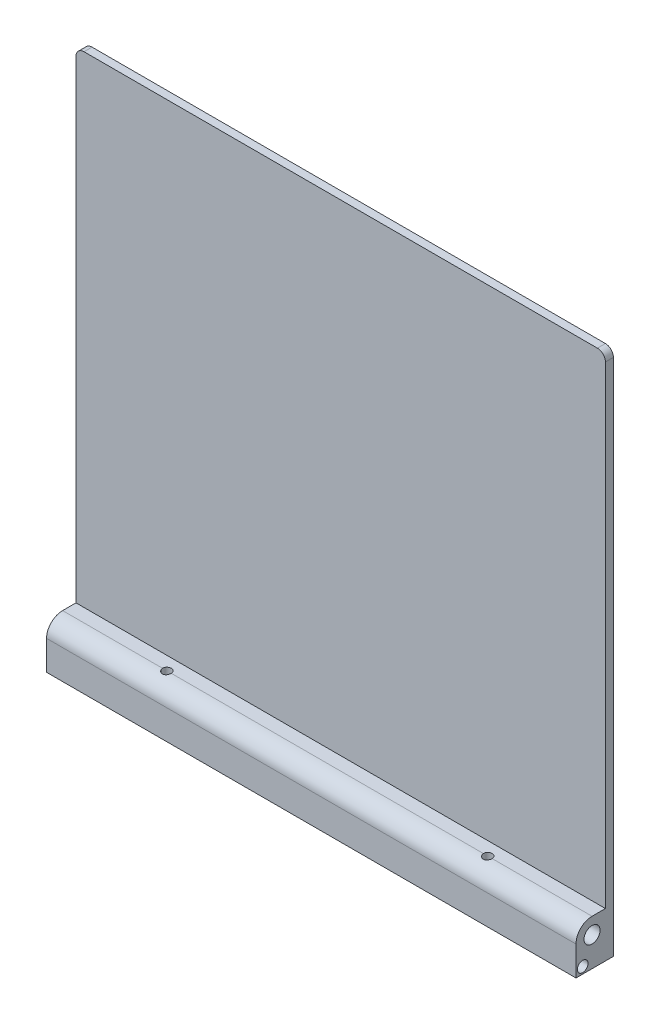
ISO-10303-21;
HEADER;
FILE_DESCRIPTION(('STEP AP214'),'2;1');
FILE_NAME('part.step','',(''),(''),'','','');
FILE_SCHEMA(('AUTOMOTIVE_DESIGN { 1 0 10303 214 1 1 1 1 }'));
ENDSEC;
DATA;
#1=APPLICATION_CONTEXT('core data for automotive mechanical design processes');
#2=APPLICATION_PROTOCOL_DEFINITION('international standard','automotive_design',2000,#1);
#3=PRODUCT_CONTEXT('',#1,'mechanical');
#4=PRODUCT('Part','Part','',(#3));
#5=PRODUCT_RELATED_PRODUCT_CATEGORY('part','',(#4));
#6=PRODUCT_DEFINITION_FORMATION('','',#4);
#7=PRODUCT_DEFINITION_CONTEXT('part definition',#1,'design');
#8=PRODUCT_DEFINITION('design','',#6,#7);
#9=PRODUCT_DEFINITION_SHAPE('','',#8);
#10=(LENGTH_UNIT() NAMED_UNIT(*) SI_UNIT(.MILLI.,.METRE.));
#11=(NAMED_UNIT(*) PLANE_ANGLE_UNIT() SI_UNIT($,.RADIAN.));
#12=(NAMED_UNIT(*) SI_UNIT($,.STERADIAN.) SOLID_ANGLE_UNIT());
#13=UNCERTAINTY_MEASURE_WITH_UNIT(LENGTH_MEASURE(1.E-05),#10,'distance_accuracy_value','');
#14=(GEOMETRIC_REPRESENTATION_CONTEXT(3) GLOBAL_UNCERTAINTY_ASSIGNED_CONTEXT((#13)) GLOBAL_UNIT_ASSIGNED_CONTEXT((#10,
#11,#12)) REPRESENTATION_CONTEXT('',''));
#15=CARTESIAN_POINT('',(0.,0.,0.));
#16=DIRECTION('',(0.,0.,1.));
#17=DIRECTION('',(1.,0.,0.));
#18=AXIS2_PLACEMENT_3D('',#15,#16,#17);
#19=CARTESIAN_POINT('',(216.439088914586,-6.,8.00000000000001));
#20=DIRECTION('',(-1.,0.,0.));
#21=DIRECTION('',(0.,0.,1.));
#22=AXIS2_PLACEMENT_3D('',#19,#20,#21);
#23=CYLINDRICAL_SURFACE('',#22,6.);
#24=CARTESIAN_POINT('',(0.,-6.,8.00000000000001));
#25=DIRECTION('',(-1.,0.,0.));
#26=DIRECTION('',(0.,0.,1.));
#27=AXIS2_PLACEMENT_3D('',#24,#25,#26);
#28=CIRCLE('',#27,6.);
#29=CARTESIAN_POINT('',(0.,-6.,14.));
#30=VERTEX_POINT('',#29);
#31=CARTESIAN_POINT('',(0.,0.,8.00000000000001));
#32=VERTEX_POINT('',#31);
#33=EDGE_CURVE('E249',#30,#32,#28,.T.);
#34=ORIENTED_EDGE('',*,*,#33,.F.);
#35=DIRECTION('',(-1.,0.,0.));
#36=VECTOR('',#35,1.);
#37=CARTESIAN_POINT('',(215.804493814765,-6.,14.));
#38=LINE('',#37,#36);
#39=CARTESIAN_POINT('',(198.,-6.,14.));
#40=VERTEX_POINT('',#39);
#41=EDGE_CURVE('E157',#40,#30,#38,.T.);
#42=ORIENTED_EDGE('',*,*,#41,.F.);
#43=CARTESIAN_POINT('',(198.,-6.,8.00000000000001));
#44=DIRECTION('',(-1.,0.,0.));
#45=DIRECTION('',(0.,0.,1.));
#46=AXIS2_PLACEMENT_3D('',#43,#44,#45);
#47=CIRCLE('',#46,6.);
#48=CARTESIAN_POINT('',(198.,0.,8.00000000000001));
#49=VERTEX_POINT('',#48);
#50=EDGE_CURVE('E243',#49,#40,#47,.F.);
#51=ORIENTED_EDGE('',*,*,#50,.F.);
#52=DIRECTION('',(-1.,0.,0.));
#53=VECTOR('',#52,1.);
#54=CARTESIAN_POINT('',(216.439088914586,0.,8.00000000000001));
#55=LINE('',#54,#53);
#56=CARTESIAN_POINT('',(160.650000000001,0.,8.00000000000001));
#57=VERTEX_POINT('',#56);
#58=EDGE_CURVE('E240',#49,#57,#55,.T.);
#59=ORIENTED_EDGE('',*,*,#58,.T.);
#60=CARTESIAN_POINT('',(159.000000000001,-0.231334643091484,9.65000000000108));
#61=CARTESIAN_POINT('',(159.090780446643,-0.231333184577869,9.6499980374458));
#62=CARTESIAN_POINT('',(159.181581230617,-0.2291683151038,9.64248258154236));
#63=CARTESIAN_POINT('',(159.360552707724,-0.220770681012636,9.6126811316094));
#64=CARTESIAN_POINT('',(159.448722170135,-0.214536043124084,9.59038833565297));
#65=CARTESIAN_POINT('',(159.61981578719,-0.198757204100084,9.53182668713323));
#66=CARTESIAN_POINT('',(159.702747429605,-0.189217859935664,9.49557833657857));
#67=CARTESIAN_POINT('',(159.861367218156,-0.167910731752652,9.4101995918548));
#68=CARTESIAN_POINT('',(159.93705467109,-0.156142734792821,9.36106796655389));
#69=CARTESIAN_POINT('',(160.081050462319,-0.131353471100434,9.24991964519009));
#70=CARTESIAN_POINT('',(160.149137611229,-0.118308873369947,9.18762153463272));
#71=CARTESIAN_POINT('',(160.27404120176,-0.0926370696256836,9.05251338107121));
#72=CARTESIAN_POINT('',(160.330856411459,-0.0800099093596002,8.97970219058304));
#73=CARTESIAN_POINT('',(160.432534803774,-0.0563342433707218,8.82409141792287));
#74=CARTESIAN_POINT('',(160.47717673638,-0.0453164621374391,8.74114218631693));
#75=CARTESIAN_POINT('',(160.551796138776,-0.0263694623862123,8.56856133857666));
#76=CARTESIAN_POINT('',(160.581776244723,-0.0184396887050379,8.47893092704279));
#77=CARTESIAN_POINT('',(160.625501244684,-0.0067271709789311,8.29784211079025));
#78=CARTESIAN_POINT('',(160.639622716018,-0.00284839647898989,8.20648095369833));
#79=CARTESIAN_POINT('',(160.652415798681,0.000661429832006318,8.02260946272118));
#80=CARTESIAN_POINT('',(160.651090153618,0.000293235959670551,7.9300993358235));
#81=CARTESIAN_POINT('',(160.633288853611,-0.00457961948819231,7.74918199533245));
#82=CARTESIAN_POINT('',(160.617220272018,-0.00897313171134139,7.66073127381515));
#83=CARTESIAN_POINT('',(160.571048615408,-0.0212708766331154,7.48783375996964));
#84=CARTESIAN_POINT('',(160.540944715667,-0.0291753156347073,7.40338720324994));
#85=CARTESIAN_POINT('',(160.467253854455,-0.0477689263613935,7.23987323009191));
#86=CARTESIAN_POINT('',(160.423530199888,-0.0584861483746638,7.16087073803445));
#87=CARTESIAN_POINT('',(160.323946608355,-0.0815547954136656,7.01118747141222));
#88=CARTESIAN_POINT('',(160.268084177406,-0.0939065560607308,6.94050841155361));
#89=CARTESIAN_POINT('',(160.143659388682,-0.119384670541564,6.8070481506678));
#90=CARTESIAN_POINT('',(160.074742454414,-0.132523149402228,6.74459943425751));
#91=CARTESIAN_POINT('',(159.927279578084,-0.157733376834685,6.6320615138026));
#92=CARTESIAN_POINT('',(159.848732969804,-0.169805051501158,6.5819731656208));
#93=CARTESIAN_POINT('',(159.683482923082,-0.191565931641349,6.49530296236955));
#94=CARTESIAN_POINT('',(159.596726812738,-0.201238076703339,6.45881694658834));
#95=CARTESIAN_POINT('',(159.417978385097,-0.21689563764146,6.40105990863508));
#96=CARTESIAN_POINT('',(159.325987468918,-0.222882035000597,6.37978483567586));
#97=CARTESIAN_POINT('',(159.142503589206,-0.230279646794182,6.35363821675315));
#98=CARTESIAN_POINT('',(159.051087152066,-0.231829777142019,6.34826842306065));
#99=CARTESIAN_POINT('',(158.868661469602,-0.230560406123488,6.35270752175291));
#100=CARTESIAN_POINT('',(158.777652178977,-0.227741403654584,6.36251468112917));
#101=CARTESIAN_POINT('',(158.600581121326,-0.21818611700046,6.39658889920001));
#102=CARTESIAN_POINT('',(158.514455856723,-0.211532404882695,6.42055141705246));
#103=CARTESIAN_POINT('',(158.347448316786,-0.195139249995293,6.4819111916512));
#104=CARTESIAN_POINT('',(158.266566759489,-0.18539938569908,6.51931028374496));
#105=CARTESIAN_POINT('',(158.110271905821,-0.163650044115829,6.60747696114744));
#106=CARTESIAN_POINT('',(158.03502884188,-0.15159318670793,6.65853435771715));
#107=CARTESIAN_POINT('',(157.893995637401,-0.12667743556325,6.77221275597697));
#108=CARTESIAN_POINT('',(157.82820739541,-0.113818381485251,6.83483607437254));
#109=CARTESIAN_POINT('',(157.705856644964,-0.0882650060544926,6.97218249409995));
#110=CARTESIAN_POINT('',(157.649643014994,-0.0755881242617806,7.04722029655199));
#111=CARTESIAN_POINT('',(157.550606969559,-0.0522343100453501,7.20595405352921));
#112=CARTESIAN_POINT('',(157.507783842673,-0.0415572713846145,7.28964954776778));
#113=CARTESIAN_POINT('',(157.437145586688,-0.0234749362220139,7.46273498164717));
#114=CARTESIAN_POINT('',(157.409217299066,-0.016045050911557,7.55207604558958));
#115=CARTESIAN_POINT('',(157.368840483033,-0.00518574439174027,7.73441968202578));
#116=CARTESIAN_POINT('',(157.356388288908,-0.00175537585644535,7.82742138206369));
#117=CARTESIAN_POINT('',(157.34755880959,0.000670516910508835,8.01119587731008));
#118=CARTESIAN_POINT('',(157.350671267738,-0.000193180804237091,8.10194263481183));
#119=CARTESIAN_POINT('',(157.371689581811,-0.00593678485058757,8.28156955465771));
#120=CARTESIAN_POINT('',(157.389594818206,-0.0108165229880206,8.37044979501283));
#121=CARTESIAN_POINT('',(157.43939476089,-0.024012898423629,8.54316574584037));
#122=CARTESIAN_POINT('',(157.471180148092,-0.0323026496845086,8.62703516812492));
#123=CARTESIAN_POINT('',(157.547740832633,-0.051454984448929,8.78829796642143));
#124=CARTESIAN_POINT('',(157.592518037685,-0.0623179457584076,8.86569038920186));
#125=CARTESIAN_POINT('',(157.695252035988,-0.0858387553894682,9.01415403207526));
#126=CARTESIAN_POINT('',(157.753542889265,-0.0985383592041446,9.08498744614512));
#127=CARTESIAN_POINT('',(157.881023726441,-0.124141270716246,9.21603947801577));
#128=CARTESIAN_POINT('',(157.950216635353,-0.137044632243324,9.27625523789378));
#129=CARTESIAN_POINT('',(158.099517805202,-0.161949720382164,9.38578701268343));
#130=CARTESIAN_POINT('',(158.179846663218,-0.173922678042025,9.43480949541613));
#131=CARTESIAN_POINT('',(158.34792560602,-0.195193671104267,9.51858609627395));
#132=CARTESIAN_POINT('',(158.435671092429,-0.204493348448847,9.55334897834437));
#133=CARTESIAN_POINT('',(158.602496332204,-0.218160566514748,9.60340195745997));
#134=CARTESIAN_POINT('',(158.68089624802,-0.223059341152634,9.62083357797661));
#135=CARTESIAN_POINT('',(158.839525640346,-0.229646812910847,9.64413270597074));
#136=CARTESIAN_POINT('',(158.919754874757,-0.231335932340569,9.6500017347964));
#137=CARTESIAN_POINT('',(159.000000000001,-0.231334643091484,9.65000000000108));
#138=B_SPLINE_CURVE_WITH_KNOTS('',3,(#60,#61,#62,#63,#64,#65,#66,#67,#68,#69,#70,#71,#72,#73,
#74,#75,#76,#77,#78,#79,#80,#81,#82,#83,#84,#85,#86,#87,#88,#89,#90,#91,#92,#93,#94,#95,#96,#97,
#98,#99,#100,#101,#102,#103,#104,#105,#106,#107,#108,#109,#110,#111,#112,#113,#114,#115,#116,
#117,#118,#119,#120,#121,#122,#123,#124,#125,#126,#127,#128,#129,#130,#131,#132,#133,#134,#135,
#136,#137),.UNSPECIFIED.,.T.,.F.,(4,2,2,2,2,2,2,2,2,2,2,2,2,2,2,2,2,2,2,2,2,2,2,2,2,2,2,2,2,2,2,
2,2,2,2,2,2,2,4),(0.,0.272046051104002,0.544217410515604,0.815990441281146,1.08778945227583,
1.36612384486569,1.64448864015851,1.9276186218504,2.21069767879602,2.48690242321263,
2.76305811084347,3.03181099442103,3.30057967207722,3.57213780160769,3.84375177719018,
4.12421818647044,4.40470401050128,4.68713031851459,4.96948138625912,5.24288876991943,
5.5162649363549,5.7839634844484,6.05169861230975,6.32564040616637,6.59963713140798,
6.88212071608139,7.16458929021239,7.44488018041171,7.7251046673873,7.99620396443573,
8.26729190826143,8.53628224078244,8.80531209172674,9.08187822938632,9.35851869627833,
9.64174339988028,9.9247937719284,10.165299774618,10.4057741306127),.UNSPECIFIED.);
#139=CARTESIAN_POINT('',(157.350000000001,0.,8.00000000000001));
#140=VERTEX_POINT('',#139);
#141=EDGE_CURVE('E165',#140,#57,#138,.T.);
#142=ORIENTED_EDGE('',*,*,#141,.F.);
#143=CARTESIAN_POINT('',(40.6500000000014,0.,8.00000000000001));
#144=VERTEX_POINT('',#143);
#145=EDGE_CURVE('E244',#140,#144,#55,.T.);
#146=ORIENTED_EDGE('',*,*,#145,.T.);
#147=CARTESIAN_POINT('',(39.0000000000014,-0.231334643091483,9.65000000000108));
#148=CARTESIAN_POINT('',(39.0907804466431,-0.231333184577867,9.6499980374458));
#149=CARTESIAN_POINT('',(39.181581230617,-0.229168315103798,9.64248258154236));
#150=CARTESIAN_POINT('',(39.3605527077239,-0.220770681012634,9.61268113160939));
#151=CARTESIAN_POINT('',(39.4487221701346,-0.214536043124083,9.59038833565297));
#152=CARTESIAN_POINT('',(39.6198157871895,-0.198757204100082,9.53182668713322));
#153=CARTESIAN_POINT('',(39.7027474296049,-0.189217859935662,9.49557833657856));
#154=CARTESIAN_POINT('',(39.8613672181562,-0.16791073175265,9.41019959185479));
#155=CARTESIAN_POINT('',(39.9370546710901,-0.156142734792817,9.36106796655388));
#156=CARTESIAN_POINT('',(40.0810504623185,-0.131353471100431,9.24991964519008));
#157=CARTESIAN_POINT('',(40.1491376112293,-0.118308873369944,9.18762153463271));
#158=CARTESIAN_POINT('',(40.2740412017603,-0.0926370696256821,9.05251338107121));
#159=CARTESIAN_POINT('',(40.3308564114592,-0.0800099093595998,8.97970219058304));
#160=CARTESIAN_POINT('',(40.4325348037744,-0.0563342433707219,8.82409141792287));
#161=CARTESIAN_POINT('',(40.4771767363804,-0.0453164621374386,8.74114218631693));
#162=CARTESIAN_POINT('',(40.5517961387761,-0.0263694623862113,8.56856133857664));
#163=CARTESIAN_POINT('',(40.581776244723,-0.0184396887050371,8.47893092704278));
#164=CARTESIAN_POINT('',(40.625501244684,-0.00672717097893109,8.29784211079023));
#165=CARTESIAN_POINT('',(40.6396227160181,-0.00284839647899013,8.20648095369832));
#166=CARTESIAN_POINT('',(40.652415798681,0.000661429832005869,8.02260946272117));
#167=CARTESIAN_POINT('',(40.6510901536176,0.000293235959669928,7.9300993358235));
#168=CARTESIAN_POINT('',(40.6332888536105,-0.00457961948819294,7.74918199533244));
#169=CARTESIAN_POINT('',(40.6172202720181,-0.00897313171134189,7.66073127381514));
#170=CARTESIAN_POINT('',(40.5710486154083,-0.0212708766331157,7.48783375996963));
#171=CARTESIAN_POINT('',(40.5409447156668,-0.0291753156347072,7.40338720324994));
#172=CARTESIAN_POINT('',(40.4672538544547,-0.0477689263613935,7.2398732300919));
#173=CARTESIAN_POINT('',(40.4235301998875,-0.0584861483746643,7.16087073803444));
#174=CARTESIAN_POINT('',(40.3239466083548,-0.0815547954136663,7.01118747141222));
#175=CARTESIAN_POINT('',(40.2680841774063,-0.0939065560607313,6.94050841155362));
#176=CARTESIAN_POINT('',(40.1436593886821,-0.119384670541564,6.80704815066781));
#177=CARTESIAN_POINT('',(40.0747424544139,-0.132523149402227,6.74459943425752));
#178=CARTESIAN_POINT('',(39.9272795780844,-0.157733376834682,6.63206151380261));
#179=CARTESIAN_POINT('',(39.8487329698038,-0.169805051501153,6.58197316562082));
#180=CARTESIAN_POINT('',(39.6834829230824,-0.191565931641342,6.49530296236957));
#181=CARTESIAN_POINT('',(39.5967268127376,-0.201238076703332,6.45881694658837));
#182=CARTESIAN_POINT('',(39.4179783850966,-0.216895637641453,6.40105990863511));
#183=CARTESIAN_POINT('',(39.3259874689185,-0.22288203500059,6.37978483567589));
#184=CARTESIAN_POINT('',(39.1425035892063,-0.230279646794176,6.35363821675317));
#185=CARTESIAN_POINT('',(39.0510871520657,-0.231829777142012,6.34826842306068));
#186=CARTESIAN_POINT('',(38.8686614696015,-0.23056040612348,6.35270752175294));
#187=CARTESIAN_POINT('',(38.7776521789772,-0.227741403654574,6.3625146811292));
#188=CARTESIAN_POINT('',(38.6005811213261,-0.21818611700045,6.39658889920005));
#189=CARTESIAN_POINT('',(38.5144558567235,-0.211532404882687,6.42055141705249));
#190=CARTESIAN_POINT('',(38.3474483167859,-0.195139249995287,6.48191119165123));
#191=CARTESIAN_POINT('',(38.2665667594892,-0.185399385699073,6.51931028374499));
#192=CARTESIAN_POINT('',(38.1102719058213,-0.163650044115822,6.60747696114747));
#193=CARTESIAN_POINT('',(38.03502884188,-0.151593186707925,6.65853435771717));
#194=CARTESIAN_POINT('',(37.8939956374015,-0.126677435563245,6.772212755977));
#195=CARTESIAN_POINT('',(37.8282073954098,-0.113818381485246,6.83483607437257));
#196=CARTESIAN_POINT('',(37.7058566449638,-0.088265006054486,6.97218249409999));
#197=CARTESIAN_POINT('',(37.6496430149942,-0.0755881242617735,7.04722029655204));
#198=CARTESIAN_POINT('',(37.5506069695589,-0.0522343100453432,7.20595405352927));
#199=CARTESIAN_POINT('',(37.5077838426728,-0.0415572713846083,7.28964954776783));
#200=CARTESIAN_POINT('',(37.4371455866881,-0.0234749362220092,7.46273498164722));
#201=CARTESIAN_POINT('',(37.4092172990656,-0.0160450509115527,7.55207604558962));
#202=CARTESIAN_POINT('',(37.3688404830331,-0.00518574439173754,7.73441968202582));
#203=CARTESIAN_POINT('',(37.356388288908,-0.00175537585644379,7.82742138206373));
#204=CARTESIAN_POINT('',(37.3475588095898,0.000670516910509029,8.01119587731011));
#205=CARTESIAN_POINT('',(37.3506712677378,-0.000193180804237234,8.10194263481186));
#206=CARTESIAN_POINT('',(37.3716895818112,-0.00593678485058871,8.28156955465774));
#207=CARTESIAN_POINT('',(37.3895948182062,-0.0108165229880224,8.37044979501286));
#208=CARTESIAN_POINT('',(37.4393947608899,-0.0240128984236309,8.54316574584039));
#209=CARTESIAN_POINT('',(37.4711801480919,-0.0323026496845098,8.62703516812494));
#210=CARTESIAN_POINT('',(37.5477408326331,-0.0514549844489302,8.78829796642145));
#211=CARTESIAN_POINT('',(37.5925180376848,-0.0623179457584098,8.86569038920188));
#212=CARTESIAN_POINT('',(37.6952520359878,-0.0858387553894722,9.01415403207528));
#213=CARTESIAN_POINT('',(37.7535428892647,-0.0985383592041496,9.08498744614514));
#214=CARTESIAN_POINT('',(37.8810237264411,-0.124141270716251,9.21603947801579));
#215=CARTESIAN_POINT('',(37.9502166353535,-0.137044632243327,9.2762552378938));
#216=CARTESIAN_POINT('',(38.0995178052019,-0.161949720382166,9.38578701268344));
#217=CARTESIAN_POINT('',(38.1798466632184,-0.173922678042027,9.43480949541613));
#218=CARTESIAN_POINT('',(38.3479256060203,-0.195193671104268,9.51858609627395));
#219=CARTESIAN_POINT('',(38.4356710924295,-0.204493348448847,9.55334897834437));
#220=CARTESIAN_POINT('',(38.6024963322037,-0.218160566514748,9.60340195745997));
#221=CARTESIAN_POINT('',(38.6808962480202,-0.223059341152634,9.62083357797661));
#222=CARTESIAN_POINT('',(38.8395256403459,-0.229646812910847,9.64413270597074));
#223=CARTESIAN_POINT('',(38.919754874757,-0.231335932340569,9.6500017347964));
#224=CARTESIAN_POINT('',(39.0000000000014,-0.231334643091483,9.65000000000108));
#225=B_SPLINE_CURVE_WITH_KNOTS('',3,(#147,#148,#149,#150,#151,#152,#153,#154,#155,#156,#157,
#158,#159,#160,#161,#162,#163,#164,#165,#166,#167,#168,#169,#170,#171,#172,#173,#174,#175,#176,
#177,#178,#179,#180,#181,#182,#183,#184,#185,#186,#187,#188,#189,#190,#191,#192,#193,#194,#195,
#196,#197,#198,#199,#200,#201,#202,#203,#204,#205,#206,#207,#208,#209,#210,#211,#212,#213,#214,
#215,#216,#217,#218,#219,#220,#221,#222,#223,#224),.UNSPECIFIED.,.T.,.F.,(4,2,2,2,2,2,2,2,2,2,2,
2,2,2,2,2,2,2,2,2,2,2,2,2,2,2,2,2,2,2,2,2,2,2,2,2,2,2,4),(0.,0.272046051104002,
0.544217410515611,0.815990441281157,1.08778945227585,1.36612384486568,1.64448864015849,
1.92761862185039,2.21069767879602,2.48690242321262,2.76305811084346,3.03181099442102,
3.3005796720772,3.57213780160768,3.84375177719016,4.12421818647042,4.40470401050123,
4.68713031851455,4.96948138625906,5.24288876991938,5.51626493635488,5.78396348444836,
6.05169861230971,6.32564040616631,6.59963713140793,6.88212071608136,7.16458929021236,
7.44488018041166,7.72510466738725,7.99620396443568,8.26729190826136,8.53628224078237,
8.80531209172667,9.08187822938626,9.35851869627828,9.64174339988022,9.9247937719283,
10.1652997746179,10.4057741306126),.UNSPECIFIED.);
#226=CARTESIAN_POINT('',(37.3500000000014,0.,8.00000000000001));
#227=VERTEX_POINT('',#226);
#228=EDGE_CURVE('E173',#227,#144,#225,.T.);
#229=ORIENTED_EDGE('',*,*,#228,.F.);
#230=EDGE_CURVE('E245',#227,#32,#55,.T.);
#231=ORIENTED_EDGE('',*,*,#230,.T.);
#232=EDGE_LOOP('',(#34,#42,#51,#59,#142,#146,#229,#231));
#233=FACE_BOUND('',#232,.T.);
#234=ADVANCED_FACE('F36',(#233),#23,.T.);
#235=CARTESIAN_POINT('',(0.,0.,3.));
#236=DIRECTION('',(1.,0.,0.));
#237=DIRECTION('',(0.,0.,-1.));
#238=AXIS2_PLACEMENT_3D('',#235,#236,#237);
#239=PLANE('',#238);
#240=CARTESIAN_POINT('',(0.,-14.5,11.5));
#241=DIRECTION('',(1.,0.,0.));
#242=DIRECTION('',(0.,0.,-1.));
#243=AXIS2_PLACEMENT_3D('',#240,#241,#242);
#244=CIRCLE('',#243,2.);
#245=CARTESIAN_POINT('',(0.,-14.5,9.50000000000001));
#246=VERTEX_POINT('',#245);
#247=EDGE_CURVE('E429',#246,#246,#244,.T.);
#248=ORIENTED_EDGE('',*,*,#247,.T.);
#249=EDGE_LOOP('',(#248));
#250=FACE_BOUND('',#249,.T.);
#251=CARTESIAN_POINT('',(0.,-6.,8.00000000000001));
#252=DIRECTION('',(-1.,0.,0.));
#253=DIRECTION('',(0.,0.,1.));
#254=AXIS2_PLACEMENT_3D('',#251,#252,#253);
#255=CIRCLE('',#254,3.);
#256=CARTESIAN_POINT('',(0.,-6.,11.));
#257=VERTEX_POINT('',#256);
#258=EDGE_CURVE('E251',#257,#257,#255,.T.);
#259=ORIENTED_EDGE('',*,*,#258,.F.);
#260=EDGE_LOOP('',(#259));
#261=FACE_BOUND('',#260,.T.);
#262=DIRECTION('',(0.,-1.,0.));
#263=VECTOR('',#262,1.);
#264=CARTESIAN_POINT('',(0.,0.,0.));
#265=LINE('',#264,#263);
#266=CARTESIAN_POINT('',(0.,177.,0.));
#267=VERTEX_POINT('',#266);
#268=CARTESIAN_POINT('',(0.,-17.,0.));
#269=VERTEX_POINT('',#268);
#270=EDGE_CURVE('E121',#267,#269,#265,.T.);
#271=ORIENTED_EDGE('',*,*,#270,.T.);
#272=DIRECTION('',(0.,0.,1.));
#273=VECTOR('',#272,1.);
#274=CARTESIAN_POINT('',(0.,-17.,0.));
#275=LINE('',#274,#273);
#276=CARTESIAN_POINT('',(0.,-17.,14.));
#277=VERTEX_POINT('',#276);
#278=EDGE_CURVE('E126',#269,#277,#275,.T.);
#279=ORIENTED_EDGE('',*,*,#278,.T.);
#280=DIRECTION('',(0.,1.,0.));
#281=VECTOR('',#280,1.);
#282=CARTESIAN_POINT('',(0.,-17.,14.));
#283=LINE('',#282,#281);
#284=EDGE_CURVE('E146',#277,#30,#283,.T.);
#285=ORIENTED_EDGE('',*,*,#284,.T.);
#286=ORIENTED_EDGE('',*,*,#33,.T.);
#287=DIRECTION('',(0.,0.,-1.));
#288=VECTOR('',#287,1.);
#289=CARTESIAN_POINT('',(0.,0.,0.));
#290=LINE('',#289,#288);
#291=CARTESIAN_POINT('',(0.,0.,3.));
#292=VERTEX_POINT('',#291);
#293=EDGE_CURVE('E246',#32,#292,#290,.T.);
#294=ORIENTED_EDGE('',*,*,#293,.T.);
#295=DIRECTION('',(0.,-1.,0.));
#296=VECTOR('',#295,1.);
#297=CARTESIAN_POINT('',(0.,0.,3.));
#298=LINE('',#297,#296);
#299=CARTESIAN_POINT('',(0.,177.,3.));
#300=VERTEX_POINT('',#299);
#301=EDGE_CURVE('E231',#300,#292,#298,.T.);
#302=ORIENTED_EDGE('',*,*,#301,.F.);
#303=DIRECTION('',(0.,0.,-1.));
#304=VECTOR('',#303,1.);
#305=CARTESIAN_POINT('',(0.,177.,3.));
#306=LINE('',#305,#304);
#307=EDGE_CURVE('E11',#300,#267,#306,.T.);
#308=ORIENTED_EDGE('',*,*,#307,.T.);
#309=EDGE_LOOP('',(#271,#279,#285,#286,#294,#302,#308));
#310=FACE_BOUND('',#309,.T.);
#311=ADVANCED_FACE('F123',(#250,#261,#310),#239,.F.);
#312=CARTESIAN_POINT('',(198.,0.,3.));
#313=DIRECTION('',(-1.,0.,0.));
#314=DIRECTION('',(0.,0.,1.));
#315=AXIS2_PLACEMENT_3D('',#312,#313,#314);
#316=PLANE('',#315);
#317=CARTESIAN_POINT('',(198.,-14.5,11.5));
#318=DIRECTION('',(1.,0.,0.));
#319=DIRECTION('',(0.,0.,-1.));
#320=AXIS2_PLACEMENT_3D('',#317,#318,#319);
#321=CIRCLE('',#320,2.);
#322=CARTESIAN_POINT('',(198.,-14.5,9.50000000000001));
#323=VERTEX_POINT('',#322);
#324=EDGE_CURVE('E151',#323,#323,#321,.T.);
#325=ORIENTED_EDGE('',*,*,#324,.F.);
#326=EDGE_LOOP('',(#325));
#327=FACE_BOUND('',#326,.T.);
#328=DIRECTION('',(0.,1.,0.));
#329=VECTOR('',#328,1.);
#330=CARTESIAN_POINT('',(198.,0.,0.));
#331=LINE('',#330,#329);
#332=CARTESIAN_POINT('',(198.,-17.,0.));
#333=VERTEX_POINT('',#332);
#334=CARTESIAN_POINT('',(198.,177.,0.));
#335=VERTEX_POINT('',#334);
#336=EDGE_CURVE('E129',#333,#335,#331,.T.);
#337=ORIENTED_EDGE('',*,*,#336,.T.);
#338=DIRECTION('',(0.,0.,-1.));
#339=VECTOR('',#338,1.);
#340=CARTESIAN_POINT('',(198.,177.,3.));
#341=LINE('',#340,#339);
#342=CARTESIAN_POINT('',(198.,177.,3.));
#343=VERTEX_POINT('',#342);
#344=EDGE_CURVE('E59',#335,#343,#341,.F.);
#345=ORIENTED_EDGE('',*,*,#344,.T.);
#346=DIRECTION('',(0.,1.,0.));
#347=VECTOR('',#346,1.);
#348=CARTESIAN_POINT('',(198.,0.,3.));
#349=LINE('',#348,#347);
#350=CARTESIAN_POINT('',(198.,0.,3.));
#351=VERTEX_POINT('',#350);
#352=EDGE_CURVE('E221',#351,#343,#349,.T.);
#353=ORIENTED_EDGE('',*,*,#352,.F.);
#354=DIRECTION('',(0.,0.,1.));
#355=VECTOR('',#354,1.);
#356=CARTESIAN_POINT('',(198.,0.,0.));
#357=LINE('',#356,#355);
#358=EDGE_CURVE('E239',#351,#49,#357,.T.);
#359=ORIENTED_EDGE('',*,*,#358,.T.);
#360=ORIENTED_EDGE('',*,*,#50,.T.);
#361=DIRECTION('',(0.,-1.,0.));
#362=VECTOR('',#361,1.);
#363=CARTESIAN_POINT('',(198.,-17.,14.));
#364=LINE('',#363,#362);
#365=CARTESIAN_POINT('',(198.,-17.,14.));
#366=VERTEX_POINT('',#365);
#367=EDGE_CURVE('E154',#40,#366,#364,.T.);
#368=ORIENTED_EDGE('',*,*,#367,.T.);
#369=DIRECTION('',(0.,0.,-1.));
#370=VECTOR('',#369,1.);
#371=CARTESIAN_POINT('',(198.,-17.,0.));
#372=LINE('',#371,#370);
#373=EDGE_CURVE('E140',#366,#333,#372,.T.);
#374=ORIENTED_EDGE('',*,*,#373,.T.);
#375=EDGE_LOOP('',(#337,#345,#353,#359,#360,#368,#374));
#376=FACE_BOUND('',#375,.T.);
#377=CARTESIAN_POINT('',(198.,-6.,8.00000000000001));
#378=DIRECTION('',(-1.,0.,0.));
#379=DIRECTION('',(0.,0.,1.));
#380=AXIS2_PLACEMENT_3D('',#377,#378,#379);
#381=CIRCLE('',#380,3.);
#382=CARTESIAN_POINT('',(198.,-6.,11.));
#383=VERTEX_POINT('',#382);
#384=EDGE_CURVE('E130',#383,#383,#381,.F.);
#385=ORIENTED_EDGE('',*,*,#384,.F.);
#386=EDGE_LOOP('',(#385));
#387=FACE_BOUND('',#386,.T.);
#388=ADVANCED_FACE('F257',(#327,#376,#387),#316,.F.);
#389=CARTESIAN_POINT('',(0.,180.,3.));
#390=DIRECTION('',(0.,-1.,0.));
#391=DIRECTION('',(0.,0.,-1.));
#392=AXIS2_PLACEMENT_3D('',#389,#390,#391);
#393=PLANE('',#392);
#394=DIRECTION('',(-1.,0.,0.));
#395=VECTOR('',#394,1.);
#396=CARTESIAN_POINT('',(0.,180.,3.));
#397=LINE('',#396,#395);
#398=CARTESIAN_POINT('',(195.,180.,3.));
#399=VERTEX_POINT('',#398);
#400=CARTESIAN_POINT('',(3.,180.,3.));
#401=VERTEX_POINT('',#400);
#402=EDGE_CURVE('E210',#399,#401,#397,.T.);
#403=ORIENTED_EDGE('',*,*,#402,.F.);
#404=DIRECTION('',(0.,0.,-1.));
#405=VECTOR('',#404,1.);
#406=CARTESIAN_POINT('',(195.,180.,3.));
#407=LINE('',#406,#405);
#408=CARTESIAN_POINT('',(195.,180.,0.));
#409=VERTEX_POINT('',#408);
#410=EDGE_CURVE('E209',#399,#409,#407,.T.);
#411=ORIENTED_EDGE('',*,*,#410,.T.);
#412=DIRECTION('',(-1.,0.,0.));
#413=VECTOR('',#412,1.);
#414=CARTESIAN_POINT('',(0.,180.,0.));
#415=LINE('',#414,#413);
#416=CARTESIAN_POINT('',(3.,180.,0.));
#417=VERTEX_POINT('',#416);
#418=EDGE_CURVE('E200',#409,#417,#415,.T.);
#419=ORIENTED_EDGE('',*,*,#418,.T.);
#420=DIRECTION('',(0.,0.,-1.));
#421=VECTOR('',#420,1.);
#422=CARTESIAN_POINT('',(3.,180.,3.));
#423=LINE('',#422,#421);
#424=EDGE_CURVE('E207',#417,#401,#423,.F.);
#425=ORIENTED_EDGE('',*,*,#424,.T.);
#426=EDGE_LOOP('',(#403,#411,#419,#425));
#427=FACE_BOUND('',#426,.T.);
#428=ADVANCED_FACE('F225',(#427),#393,.F.);
#429=CARTESIAN_POINT('',(0.,0.,3.));
#430=DIRECTION('',(0.,0.,-1.));
#431=DIRECTION('',(-1.,0.,0.));
#432=AXIS2_PLACEMENT_3D('',#429,#430,#431);
#433=PLANE('',#432);
#434=ORIENTED_EDGE('',*,*,#352,.T.);
#435=CARTESIAN_POINT('',(195.,177.,3.));
#436=DIRECTION('',(0.,0.,-1.));
#437=DIRECTION('',(-1.,0.,0.));
#438=AXIS2_PLACEMENT_3D('',#435,#436,#437);
#439=CIRCLE('',#438,3.);
#440=EDGE_CURVE('E44',#343,#399,#439,.F.);
#441=ORIENTED_EDGE('',*,*,#440,.T.);
#442=ORIENTED_EDGE('',*,*,#402,.T.);
#443=CARTESIAN_POINT('',(3.,177.,3.));
#444=DIRECTION('',(0.,0.,-1.));
#445=DIRECTION('',(-1.,0.,0.));
#446=AXIS2_PLACEMENT_3D('',#443,#444,#445);
#447=CIRCLE('',#446,3.);
#448=EDGE_CURVE('E51',#401,#300,#447,.F.);
#449=ORIENTED_EDGE('',*,*,#448,.T.);
#450=ORIENTED_EDGE('',*,*,#301,.T.);
#451=DIRECTION('',(1.,0.,0.));
#452=VECTOR('',#451,1.);
#453=CARTESIAN_POINT('',(0.,0.,3.));
#454=LINE('',#453,#452);
#455=EDGE_CURVE('E232',#292,#351,#454,.T.);
#456=ORIENTED_EDGE('',*,*,#455,.T.);
#457=EDGE_LOOP('',(#434,#441,#442,#449,#450,#456));
#458=FACE_BOUND('',#457,.T.);
#459=ADVANCED_FACE('F220',(#458),#433,.F.);
#460=CARTESIAN_POINT('',(0.,0.,0.));
#461=DIRECTION('',(0.,0.,-1.));
#462=DIRECTION('',(-1.,0.,0.));
#463=AXIS2_PLACEMENT_3D('',#460,#461,#462);
#464=PLANE('',#463);
#465=CARTESIAN_POINT('',(195.,177.,0.));
#466=DIRECTION('',(0.,0.,-1.));
#467=DIRECTION('',(-1.,0.,0.));
#468=AXIS2_PLACEMENT_3D('',#465,#466,#467);
#469=CIRCLE('',#468,3.);
#470=EDGE_CURVE('E215',#409,#335,#469,.T.);
#471=ORIENTED_EDGE('',*,*,#470,.T.);
#472=ORIENTED_EDGE('',*,*,#336,.F.);
#473=DIRECTION('',(1.,0.,0.));
#474=VECTOR('',#473,1.);
#475=CARTESIAN_POINT('',(0.,-17.,0.));
#476=LINE('',#475,#474);
#477=EDGE_CURVE('E133',#269,#333,#476,.T.);
#478=ORIENTED_EDGE('',*,*,#477,.F.);
#479=ORIENTED_EDGE('',*,*,#270,.F.);
#480=CARTESIAN_POINT('',(3.,177.,0.));
#481=DIRECTION('',(0.,0.,-1.));
#482=DIRECTION('',(-1.,0.,0.));
#483=AXIS2_PLACEMENT_3D('',#480,#481,#482);
#484=CIRCLE('',#483,3.);
#485=EDGE_CURVE('E213',#267,#417,#484,.T.);
#486=ORIENTED_EDGE('',*,*,#485,.T.);
#487=ORIENTED_EDGE('',*,*,#418,.F.);
#488=EDGE_LOOP('',(#471,#472,#478,#479,#486,#487));
#489=FACE_BOUND('',#488,.T.);
#490=ADVANCED_FACE('F135',(#489),#464,.T.);
#491=CARTESIAN_POINT('',(216.439088914586,0.,0.));
#492=DIRECTION('',(0.,1.,0.));
#493=DIRECTION('',(0.,0.,1.));
#494=AXIS2_PLACEMENT_3D('',#491,#492,#493);
#495=PLANE('',#494);
#496=CARTESIAN_POINT('',(39.0000000000014,0.,8.00000000000108));
#497=DIRECTION('',(0.,1.,0.));
#498=DIRECTION('',(0.,0.,1.));
#499=AXIS2_PLACEMENT_3D('',#496,#497,#498);
#500=CIRCLE('',#499,1.65);
#501=EDGE_CURVE('E161',#144,#227,#500,.T.);
#502=ORIENTED_EDGE('',*,*,#501,.F.);
#503=ORIENTED_EDGE('',*,*,#145,.F.);
#504=CARTESIAN_POINT('',(159.000000000001,0.,8.00000000000107));
#505=DIRECTION('',(0.,1.,0.));
#506=DIRECTION('',(0.,0.,1.));
#507=AXIS2_PLACEMENT_3D('',#504,#505,#506);
#508=CIRCLE('',#507,1.65000000000002);
#509=EDGE_CURVE('E139',#57,#140,#508,.T.);
#510=ORIENTED_EDGE('',*,*,#509,.F.);
#511=ORIENTED_EDGE('',*,*,#58,.F.);
#512=ORIENTED_EDGE('',*,*,#358,.F.);
#513=ORIENTED_EDGE('',*,*,#455,.F.);
#514=ORIENTED_EDGE('',*,*,#293,.F.);
#515=ORIENTED_EDGE('',*,*,#230,.F.);
#516=EDGE_LOOP('',(#502,#503,#510,#511,#512,#513,#514,#515));
#517=FACE_BOUND('',#516,.T.);
#518=ADVANCED_FACE('F268',(#517),#495,.T.);
#519=CARTESIAN_POINT('',(216.439088914586,-6.,8.00000000000001));
#520=DIRECTION('',(-1.,0.,0.));
#521=DIRECTION('',(0.,0.,1.));
#522=AXIS2_PLACEMENT_3D('',#519,#520,#521);
#523=CYLINDRICAL_SURFACE('',#522,3.);
#524=ORIENTED_EDGE('',*,*,#384,.T.);
#525=EDGE_LOOP('',(#524));
#526=FACE_BOUND('',#525,.T.);
#527=CARTESIAN_POINT('',(39.0000000000014,-3.49450603672719,9.65000000000108));
#528=CARTESIAN_POINT('',(39.0845622441256,-3.49449709270925,9.64999358115623));
#529=CARTESIAN_POINT('',(39.1691984196451,-3.49015721695437,9.64345412095617));
#530=CARTESIAN_POINT('',(39.3357580106574,-3.47347694527976,9.61768357796238));
#531=CARTESIAN_POINT('',(39.4176766077384,-3.46112306186729,9.59843109830629));
#532=CARTESIAN_POINT('',(39.5760581583429,-3.43030485576006,9.54839133504233));
#533=CARTESIAN_POINT('',(39.652551663641,-3.41187871746298,9.51767597794628));
#534=CARTESIAN_POINT('',(39.7992707493245,-3.37105426039359,9.44580368027431));
#535=CARTESIAN_POINT('',(39.86949501938,-3.34865511413322,9.40464456372819));
#536=CARTESIAN_POINT('',(40.0094930204873,-3.29965772830572,9.30818987552223));
#537=CARTESIAN_POINT('',(40.0785038569216,-3.27286389707212,9.2518859756865));
#538=CARTESIAN_POINT('',(40.2067154247574,-3.21966597877721,9.12882249865193));
#539=CARTESIAN_POINT('',(40.2659102794468,-3.19326213375017,9.06205670422409));
#540=CARTESIAN_POINT('',(40.3778127875262,-3.14111744666084,8.91298403880362));
#541=CARTESIAN_POINT('',(40.4295270891269,-3.11562817127708,8.82983500932754));
#542=CARTESIAN_POINT('',(40.5178779061816,-3.07083622535249,8.65434955639918));
#543=CARTESIAN_POINT('',(40.5545259108971,-3.05152884311608,8.56202020066096));
#544=CARTESIAN_POINT('',(40.608493984801,-3.02270617669625,8.37892285434443));
#545=CARTESIAN_POINT('',(40.6271681432733,-3.01250999379457,8.28866376218955));
#546=CARTESIAN_POINT('',(40.6491747783533,-3.00046879782476,8.10576884897313));
#547=CARTESIAN_POINT('',(40.6525188859999,-2.99861745347504,8.01313488342847));
#548=CARTESIAN_POINT('',(40.6441598762645,-3.00320873616286,7.83854305725778));
#549=CARTESIAN_POINT('',(40.6339956989633,-3.00880319411728,7.75648296395873));
#550=CARTESIAN_POINT('',(40.6017438606681,-3.02629860909347,7.59545106528745));
#551=CARTESIAN_POINT('',(40.5796552840274,-3.03820005041238,7.51647949757531));
#552=CARTESIAN_POINT('',(40.5241824045513,-3.06741207866691,7.3627205702147));
#553=CARTESIAN_POINT('',(40.4906790487465,-3.08477952262424,7.28798741293562));
#554=CARTESIAN_POINT('',(40.4135685538591,-3.12344578060551,7.14505825869577));
#555=CARTESIAN_POINT('',(40.3699581828163,-3.1447458517372,7.07686436270299));
#556=CARTESIAN_POINT('',(40.2685152499599,-3.1920818561752,6.94108282808258));
#557=CARTESIAN_POINT('',(40.2096560691288,-3.2183807982742,6.87435382804526));
#558=CARTESIAN_POINT('',(40.0820757945517,-3.27144362000169,6.75120622016277));
#559=CARTESIAN_POINT('',(40.0133445587429,-3.29820795258559,6.69479835294653));
#560=CARTESIAN_POINT('',(39.860702045772,-3.35183739258562,6.5889524285302));
#561=CARTESIAN_POINT('',(39.775987825025,-3.37850506442409,6.5405610191552));
#562=CARTESIAN_POINT('',(39.5979123412458,-3.42557330545121,6.45903927559911));
#563=CARTESIAN_POINT('',(39.5045612261064,-3.44598111093299,6.42589129797835));
#564=CARTESIAN_POINT('',(39.3196175660875,-3.47571131114557,6.37867519252511));
#565=CARTESIAN_POINT('',(39.2284922928204,-3.48579611824175,6.36328191851038));
#566=CARTESIAN_POINT('',(39.044438567397,-3.49578867715998,6.34802399451809));
#567=CARTESIAN_POINT('',(38.9515122989963,-3.49570806671375,6.34814158715556));
#568=CARTESIAN_POINT('',(38.781019303226,-3.4861870836415,6.36268933002527));
#569=CARTESIAN_POINT('',(38.7031832372133,-3.4781088171916,6.37503672421015));
#570=CARTESIAN_POINT('',(38.550905157293,-3.45569101683707,6.41036907454818));
#571=CARTESIAN_POINT('',(38.4764646488042,-3.44134873501758,6.43335869952878));
#572=CARTESIAN_POINT('',(38.3294315856607,-3.40735298946975,6.49025912465952));
#573=CARTESIAN_POINT('',(38.2570491793063,-3.38750113804085,6.52458941328384));
#574=CARTESIAN_POINT('',(38.1186384670183,-3.34482474371761,6.6028491192572));
#575=CARTESIAN_POINT('',(38.0526133280187,-3.32199873240428,6.64678328559649));
#576=CARTESIAN_POINT('',(37.9178240171682,-3.27161254019689,6.7510961527158));
#577=CARTESIAN_POINT('',(37.8502833445476,-3.24387528789408,6.81297743965268));
#578=CARTESIAN_POINT('',(37.7260553654188,-3.18978533522668,6.9474096575205));
#579=CARTESIAN_POINT('',(37.6693744233953,-3.16343345330008,7.01996680140781));
#580=CARTESIAN_POINT('',(37.565816435223,-3.11344113825623,7.17840856798357));
#581=CARTESIAN_POINT('',(37.5195801922196,-3.09000523715085,7.26478163550579));
#582=CARTESIAN_POINT('',(37.4427856946255,-3.0501977510135,7.4457304638209));
#583=CARTESIAN_POINT('',(37.4122111394398,-3.0338188239569,7.54029757591576));
#584=CARTESIAN_POINT('',(37.3706938816095,-3.01137674932014,7.72458220200568));
#585=CARTESIAN_POINT('',(37.358069030657,-3.00443294567565,7.81381287057578));
#586=CARTESIAN_POINT('',(37.3475681065668,-2.99866563141353,7.99338323691222));
#587=CARTESIAN_POINT('',(37.3496842641817,-2.99983784324861,8.08372232542616));
#588=CARTESIAN_POINT('',(37.3676699284632,-3.00968957572484,8.25435836629808));
#589=CARTESIAN_POINT('',(37.3822936667957,-3.01768895328183,8.33483136304888));
#590=CARTESIAN_POINT('',(37.4229648219918,-3.03955298974637,8.49198583387791));
#591=CARTESIAN_POINT('',(37.4490136019567,-3.05341834850662,8.56866685432717));
#592=CARTESIAN_POINT('',(37.512612632041,-3.08640124814582,8.71908027948212));
#593=CARTESIAN_POINT('',(37.5505255940464,-3.10568212059096,8.79262229620643));
#594=CARTESIAN_POINT('',(37.636325501489,-3.14768349385245,8.93254240527049));
#595=CARTESIAN_POINT('',(37.6842164806009,-3.17040538470382,8.99891758384575));
#596=CARTESIAN_POINT('',(37.7949260016517,-3.22025482875027,9.13072210629279));
#597=CARTESIAN_POINT('',(37.858827833727,-3.24758854059231,9.19516495605952));
#598=CARTESIAN_POINT('',(37.9965071375533,-3.30176121462997,9.31290440702928));
#599=CARTESIAN_POINT('',(38.0702964652747,-3.32859953815892,9.36618742691478));
#600=CARTESIAN_POINT('',(38.2317240000528,-3.38054891911129,9.46345962344371));
#601=CARTESIAN_POINT('',(38.319956398594,-3.40542700910459,9.50659692748136));
#602=CARTESIAN_POINT('',(38.5041788004101,-3.44747114415782,9.57680093269463));
#603=CARTESIAN_POINT('',(38.6001429528296,-3.46466172463311,9.60391885150263));
#604=CARTESIAN_POINT('',(38.7478087830599,-3.4823307458686,9.63139486596199));
#605=CARTESIAN_POINT('',(38.7978747641614,-3.48686937386928,9.63835444050038));
#606=CARTESIAN_POINT('',(38.8986183124089,-3.49295966763606,9.64765888075723));
#607=CARTESIAN_POINT('',(38.9492958659705,-3.49451139962513,9.65000384878694));
#608=CARTESIAN_POINT('',(39.0000000000014,-3.49450603672719,9.65000000000108));
#609=B_SPLINE_CURVE_WITH_KNOTS('',3,(#527,#528,#529,#530,#531,#532,#533,#534,#535,#536,#537,
#538,#539,#540,#541,#542,#543,#544,#545,#546,#547,#548,#549,#550,#551,#552,#553,#554,#555,#556,
#557,#558,#559,#560,#561,#562,#563,#564,#565,#566,#567,#568,#569,#570,#571,#572,#573,#574,#575,
#576,#577,#578,#579,#580,#581,#582,#583,#584,#585,#586,#587,#588,#589,#590,#591,#592,#593,#594,
#595,#596,#597,#598,#599,#600,#601,#602,#603,#604,#605,#606,#607,#608),.UNSPECIFIED.,.T.,.F.,(4,
2,2,2,2,2,2,2,2,2,2,2,2,2,2,2,2,2,2,2,2,2,2,2,2,2,2,2,2,2,2,2,2,2,2,2,2,2,2,2,4),(0.,
0.253471464978883,0.507370630471886,0.7597027237183,1.01208743389975,1.28998079678307,
1.56803993512362,1.86997289364907,2.17167517502769,2.44828286528195,2.72468065617503,
2.97213663093987,3.21961160997036,3.46975098230544,3.71997045333209,3.99717687977863,
4.27467015892951,4.57652503396555,4.87802964361044,5.15517475627447,5.43200258623565,
5.66859462056201,5.90529054812099,6.15196333618112,6.39875837770531,6.68465599353138,
6.9707206542104,7.27125286686233,7.57147164850528,7.84111747203323,8.11062118950815,
8.35604451303938,8.60149712555482,8.85533990697392,9.10928550569663,9.39243346006442,
9.67592402360686,9.97823556729937,10.2795752459722,10.431561941938,10.5835452681421),.UNSPECIFIED.);
#610=CARTESIAN_POINT('',(39.0000000000014,-3.49450603672719,9.65000000000108));
#611=VERTEX_POINT('',#610);
#612=EDGE_CURVE('E172',#611,#611,#609,.T.);
#613=ORIENTED_EDGE('',*,*,#612,.T.);
#614=EDGE_LOOP('',(#613));
#615=FACE_BOUND('',#614,.T.);
#616=CARTESIAN_POINT('',(159.000000000001,-3.49450603672719,9.65000000000108));
#617=CARTESIAN_POINT('',(159.084562244126,-3.49449709270925,9.64999358115623));
#618=CARTESIAN_POINT('',(159.169198419645,-3.49015721695437,9.64345412095617));
#619=CARTESIAN_POINT('',(159.335758010657,-3.47347694527976,9.61768357796238));
#620=CARTESIAN_POINT('',(159.417676607738,-3.46112306186729,9.59843109830629));
#621=CARTESIAN_POINT('',(159.576058158343,-3.43030485576006,9.54839133504233));
#622=CARTESIAN_POINT('',(159.652551663641,-3.41187871746298,9.51767597794628));
#623=CARTESIAN_POINT('',(159.799270749325,-3.37105426039359,9.44580368027431));
#624=CARTESIAN_POINT('',(159.86949501938,-3.34865511413322,9.40464456372819));
#625=CARTESIAN_POINT('',(160.009493020487,-3.29965772830572,9.30818987552223));
#626=CARTESIAN_POINT('',(160.078503856922,-3.27286389707212,9.25188597568649));
#627=CARTESIAN_POINT('',(160.206715424757,-3.2196659787772,9.12882249865192));
#628=CARTESIAN_POINT('',(160.265910279447,-3.19326213375017,9.06205670422408));
#629=CARTESIAN_POINT('',(160.377812787526,-3.14111744666084,8.91298403880362));
#630=CARTESIAN_POINT('',(160.429527089127,-3.11562817127708,8.82983500932754));
#631=CARTESIAN_POINT('',(160.517877906182,-3.07083622535249,8.65434955639918));
#632=CARTESIAN_POINT('',(160.554525910897,-3.05152884311608,8.56202020066096));
#633=CARTESIAN_POINT('',(160.608493984801,-3.02270617669625,8.37892285434443));
#634=CARTESIAN_POINT('',(160.627168143273,-3.01250999379457,8.28866376218955));
#635=CARTESIAN_POINT('',(160.649174778353,-3.00046879782476,8.10576884897313));
#636=CARTESIAN_POINT('',(160.652518886,-2.99861745347504,8.01313488342848));
#637=CARTESIAN_POINT('',(160.644159876264,-3.00320873616286,7.83854305725778));
#638=CARTESIAN_POINT('',(160.633995698963,-3.00880319411728,7.75648296395873));
#639=CARTESIAN_POINT('',(160.601743860668,-3.02629860909348,7.59545106528744));
#640=CARTESIAN_POINT('',(160.579655284027,-3.03820005041238,7.5164794975753));
#641=CARTESIAN_POINT('',(160.524182404551,-3.06741207866692,7.36272057021469));
#642=CARTESIAN_POINT('',(160.490679048747,-3.08477952262424,7.2879874129356));
#643=CARTESIAN_POINT('',(160.413568553859,-3.12344578060551,7.14505825869576));
#644=CARTESIAN_POINT('',(160.369958182816,-3.1447458517372,7.07686436270298));
#645=CARTESIAN_POINT('',(160.26851524996,-3.19208185617521,6.94108282808258));
#646=CARTESIAN_POINT('',(160.209656069129,-3.2183807982742,6.87435382804525));
#647=CARTESIAN_POINT('',(160.082075794552,-3.2714436200017,6.75120622016276));
#648=CARTESIAN_POINT('',(160.013344558743,-3.2982079525856,6.69479835294652));
#649=CARTESIAN_POINT('',(159.860702045772,-3.35183739258563,6.58895242853018));
#650=CARTESIAN_POINT('',(159.775987825025,-3.3785050644241,6.54056101915518));
#651=CARTESIAN_POINT('',(159.597912341246,-3.42557330545123,6.45903927559909));
#652=CARTESIAN_POINT('',(159.504561226106,-3.445981110933,6.42589129797833));
#653=CARTESIAN_POINT('',(159.319617566087,-3.47571131114559,6.37867519252508));
#654=CARTESIAN_POINT('',(159.22849229282,-3.48579611824176,6.36328191851035));
#655=CARTESIAN_POINT('',(159.044438567397,-3.49578867716,6.34802399451806));
#656=CARTESIAN_POINT('',(158.951512298996,-3.49570806671377,6.34814158715553));
#657=CARTESIAN_POINT('',(158.781019303226,-3.48618708364152,6.36268933002524));
#658=CARTESIAN_POINT('',(158.703183237213,-3.47810881719161,6.37503672421013));
#659=CARTESIAN_POINT('',(158.550905157293,-3.45569101683709,6.41036907454816));
#660=CARTESIAN_POINT('',(158.476464648804,-3.4413487350176,6.43335869952875));
#661=CARTESIAN_POINT('',(158.329431585661,-3.40735298946977,6.49025912465949));
#662=CARTESIAN_POINT('',(158.257049179306,-3.38750113804087,6.52458941328381));
#663=CARTESIAN_POINT('',(158.118638467018,-3.34482474371763,6.60284911925717));
#664=CARTESIAN_POINT('',(158.052613328019,-3.3219987324043,6.64678328559646));
#665=CARTESIAN_POINT('',(157.917824017168,-3.2716125401969,6.75109615271578));
#666=CARTESIAN_POINT('',(157.850283344548,-3.24387528789409,6.81297743965267));
#667=CARTESIAN_POINT('',(157.726055365419,-3.18978533522669,6.94740965752048));
#668=CARTESIAN_POINT('',(157.669374423395,-3.16343345330009,7.01996680140778));
#669=CARTESIAN_POINT('',(157.565816435223,-3.11344113825624,7.17840856798353));
#670=CARTESIAN_POINT('',(157.51958019222,-3.09000523715086,7.26478163550576));
#671=CARTESIAN_POINT('',(157.442785694625,-3.0501977510135,7.44573046382087));
#672=CARTESIAN_POINT('',(157.41221113944,-3.0338188239569,7.54029757591573));
#673=CARTESIAN_POINT('',(157.37069388161,-3.01137674932015,7.72458220200565));
#674=CARTESIAN_POINT('',(157.358069030657,-3.00443294567565,7.81381287057576));
#675=CARTESIAN_POINT('',(157.347568106567,-2.99866563141353,7.9933832369122));
#676=CARTESIAN_POINT('',(157.349684264182,-2.99983784324861,8.08372232542615));
#677=CARTESIAN_POINT('',(157.367669928463,-3.00968957572484,8.25435836629806));
#678=CARTESIAN_POINT('',(157.382293666796,-3.01768895328183,8.33483136304886));
#679=CARTESIAN_POINT('',(157.422964821992,-3.03955298974637,8.49198583387789));
#680=CARTESIAN_POINT('',(157.449013601957,-3.05341834850661,8.56866685432715));
#681=CARTESIAN_POINT('',(157.512612632041,-3.08640124814581,8.7190802794821));
#682=CARTESIAN_POINT('',(157.550525594046,-3.10568212059096,8.79262229620642));
#683=CARTESIAN_POINT('',(157.636325501489,-3.14768349385245,8.93254240527047));
#684=CARTESIAN_POINT('',(157.684216480601,-3.17040538470381,8.99891758384574));
#685=CARTESIAN_POINT('',(157.794926001652,-3.22025482875026,9.13072210629277));
#686=CARTESIAN_POINT('',(157.858827833727,-3.2475885405923,9.19516495605949));
#687=CARTESIAN_POINT('',(157.996507137553,-3.30176121462996,9.31290440702925));
#688=CARTESIAN_POINT('',(158.070296465275,-3.32859953815891,9.36618742691476));
#689=CARTESIAN_POINT('',(158.231724000053,-3.38054891911128,9.4634596234437));
#690=CARTESIAN_POINT('',(158.319956398594,-3.40542700910458,9.50659692748135));
#691=CARTESIAN_POINT('',(158.50417880041,-3.44747114415782,9.57680093269463));
#692=CARTESIAN_POINT('',(158.60014295283,-3.46466172463311,9.60391885150263));
#693=CARTESIAN_POINT('',(158.74780878306,-3.4823307458686,9.63139486596199));
#694=CARTESIAN_POINT('',(158.797874764161,-3.48686937386928,9.63835444050038));
#695=CARTESIAN_POINT('',(158.898618312409,-3.49295966763606,9.64765888075723));
#696=CARTESIAN_POINT('',(158.94929586597,-3.49451139962513,9.65000384878694));
#697=CARTESIAN_POINT('',(159.000000000001,-3.49450603672719,9.65000000000108));
#698=B_SPLINE_CURVE_WITH_KNOTS('',3,(#616,#617,#618,#619,#620,#621,#622,#623,#624,#625,#626,
#627,#628,#629,#630,#631,#632,#633,#634,#635,#636,#637,#638,#639,#640,#641,#642,#643,#644,#645,
#646,#647,#648,#649,#650,#651,#652,#653,#654,#655,#656,#657,#658,#659,#660,#661,#662,#663,#664,
#665,#666,#667,#668,#669,#670,#671,#672,#673,#674,#675,#676,#677,#678,#679,#680,#681,#682,#683,
#684,#685,#686,#687,#688,#689,#690,#691,#692,#693,#694,#695,#696,#697),.UNSPECIFIED.,.T.,.F.,(4,
2,2,2,2,2,2,2,2,2,2,2,2,2,2,2,2,2,2,2,2,2,2,2,2,2,2,2,2,2,2,2,2,2,2,2,2,2,2,2,4),(0.,
0.253471464978876,0.507370630471892,0.7597027237183,1.01208743389976,1.28998079678309,
1.56803993512362,1.86997289364907,2.1716751750277,2.44828286528195,2.72468065617504,
2.97213663093988,3.21961160997038,3.46975098230547,3.71997045333212,3.99717687977865,
4.27467015892952,4.57652503396558,4.87802964361049,5.15517475627451,5.43200258623568,
5.66859462056206,5.90529054812103,6.15196333618117,6.39875837770536,6.68465599353144,
6.97072065421045,7.27125286686237,7.57147164850534,7.84111747203329,8.11062118950822,
8.35604451303944,8.60149712555489,8.85533990697399,9.10928550569669,9.39243346006445,
9.67592402360693,9.97823556729943,10.2795752459722,10.4315619419381,10.5835452681422),.UNSPECIFIED.);
#699=CARTESIAN_POINT('',(159.000000000001,-3.49450603672719,9.65000000000108));
#700=VERTEX_POINT('',#699);
#701=EDGE_CURVE('E163',#700,#700,#698,.T.);
#702=ORIENTED_EDGE('',*,*,#701,.T.);
#703=EDGE_LOOP('',(#702));
#704=FACE_BOUND('',#703,.T.);
#705=ORIENTED_EDGE('',*,*,#258,.T.);
#706=EDGE_LOOP('',(#705));
#707=FACE_BOUND('',#706,.T.);
#708=ADVANCED_FACE('F187',(#526,#615,#704,#707),#523,.F.);
#709=CARTESIAN_POINT('',(159.000000000001,-5.,8.00000000000107));
#710=DIRECTION('',(0.,1.,0.));
#711=DIRECTION('',(0.,0.,1.));
#712=AXIS2_PLACEMENT_3D('',#709,#710,#711);
#713=CYLINDRICAL_SURFACE('',#712,1.65000000000002);
#714=ORIENTED_EDGE('',*,*,#141,.T.);
#715=ORIENTED_EDGE('',*,*,#509,.T.);
#716=EDGE_LOOP('',(#714,#715));
#717=FACE_BOUND('',#716,.T.);
#718=ORIENTED_EDGE('',*,*,#701,.F.);
#719=EDGE_LOOP('',(#718));
#720=FACE_BOUND('',#719,.T.);
#721=ADVANCED_FACE('F182',(#717,#720),#713,.F.);
#722=CARTESIAN_POINT('',(39.0000000000014,-5.,8.00000000000108));
#723=DIRECTION('',(0.,1.,0.));
#724=DIRECTION('',(0.,0.,1.));
#725=AXIS2_PLACEMENT_3D('',#722,#723,#724);
#726=CYLINDRICAL_SURFACE('',#725,1.65);
#727=ORIENTED_EDGE('',*,*,#228,.T.);
#728=ORIENTED_EDGE('',*,*,#501,.T.);
#729=EDGE_LOOP('',(#727,#728));
#730=FACE_BOUND('',#729,.T.);
#731=ORIENTED_EDGE('',*,*,#612,.F.);
#732=EDGE_LOOP('',(#731));
#733=FACE_BOUND('',#732,.T.);
#734=ADVANCED_FACE('F186',(#730,#733),#726,.F.);
#735=CARTESIAN_POINT('',(0.,-17.,0.));
#736=DIRECTION('',(0.,1.,0.));
#737=DIRECTION('',(0.,0.,1.));
#738=AXIS2_PLACEMENT_3D('',#735,#736,#737);
#739=PLANE('',#738);
#740=ORIENTED_EDGE('',*,*,#278,.F.);
#741=ORIENTED_EDGE('',*,*,#477,.T.);
#742=ORIENTED_EDGE('',*,*,#373,.F.);
#743=DIRECTION('',(-1.,0.,0.));
#744=VECTOR('',#743,1.);
#745=CARTESIAN_POINT('',(215.804493814765,-17.,14.));
#746=LINE('',#745,#744);
#747=EDGE_CURVE('E144',#366,#277,#746,.T.);
#748=ORIENTED_EDGE('',*,*,#747,.T.);
#749=EDGE_LOOP('',(#740,#741,#742,#748));
#750=FACE_BOUND('',#749,.T.);
#751=ADVANCED_FACE('F142',(#750),#739,.F.);
#752=CARTESIAN_POINT('',(195.,177.,3.));
#753=DIRECTION('',(0.,0.,-1.));
#754=DIRECTION('',(-1.,0.,0.));
#755=AXIS2_PLACEMENT_3D('',#752,#753,#754);
#756=CYLINDRICAL_SURFACE('',#755,3.);
#757=ORIENTED_EDGE('',*,*,#440,.F.);
#758=ORIENTED_EDGE('',*,*,#344,.F.);
#759=ORIENTED_EDGE('',*,*,#470,.F.);
#760=ORIENTED_EDGE('',*,*,#410,.F.);
#761=EDGE_LOOP('',(#757,#758,#759,#760));
#762=FACE_BOUND('',#761,.T.);
#763=ADVANCED_FACE('F230',(#762),#756,.T.);
#764=CARTESIAN_POINT('',(3.,177.,3.));
#765=DIRECTION('',(0.,0.,-1.));
#766=DIRECTION('',(-1.,0.,0.));
#767=AXIS2_PLACEMENT_3D('',#764,#765,#766);
#768=CYLINDRICAL_SURFACE('',#767,3.);
#769=ORIENTED_EDGE('',*,*,#448,.F.);
#770=ORIENTED_EDGE('',*,*,#424,.F.);
#771=ORIENTED_EDGE('',*,*,#485,.F.);
#772=ORIENTED_EDGE('',*,*,#307,.F.);
#773=EDGE_LOOP('',(#769,#770,#771,#772));
#774=FACE_BOUND('',#773,.T.);
#775=ADVANCED_FACE('F38',(#774),#768,.T.);
#776=CARTESIAN_POINT('',(215.804493814765,-17.,14.));
#777=DIRECTION('',(0.,0.,1.));
#778=DIRECTION('',(1.,0.,0.));
#779=AXIS2_PLACEMENT_3D('',#776,#777,#778);
#780=PLANE('',#779);
#781=ORIENTED_EDGE('',*,*,#367,.F.);
#782=ORIENTED_EDGE('',*,*,#41,.T.);
#783=ORIENTED_EDGE('',*,*,#284,.F.);
#784=ORIENTED_EDGE('',*,*,#747,.F.);
#785=EDGE_LOOP('',(#781,#782,#783,#784));
#786=FACE_BOUND('',#785,.T.);
#787=ADVANCED_FACE('F277',(#786),#780,.T.);
#788=CARTESIAN_POINT('',(194.,-14.5,11.5));
#789=DIRECTION('',(1.,0.,0.));
#790=DIRECTION('',(0.,0.,-1.));
#791=AXIS2_PLACEMENT_3D('',#788,#789,#790);
#792=CYLINDRICAL_SURFACE('',#791,2.);
#793=CARTESIAN_POINT('',(194.,-14.5,11.5));
#794=DIRECTION('',(1.,0.,0.));
#795=DIRECTION('',(0.,0.,-1.));
#796=AXIS2_PLACEMENT_3D('',#793,#794,#795);
#797=CIRCLE('',#796,2.);
#798=CARTESIAN_POINT('',(194.,-14.5,9.50000000000001));
#799=VERTEX_POINT('',#798);
#800=EDGE_CURVE('E147',#799,#799,#797,.T.);
#801=ORIENTED_EDGE('',*,*,#800,.F.);
#802=EDGE_LOOP('',(#801));
#803=FACE_BOUND('',#802,.T.);
#804=ORIENTED_EDGE('',*,*,#324,.T.);
#805=EDGE_LOOP('',(#804));
#806=FACE_BOUND('',#805,.T.);
#807=ADVANCED_FACE('F279',(#803,#806),#792,.F.);
#808=CARTESIAN_POINT('',(194.,-14.5,11.5));
#809=DIRECTION('',(1.,0.,0.));
#810=DIRECTION('',(0.,0.,-1.));
#811=AXIS2_PLACEMENT_3D('',#808,#809,#810);
#812=PLANE('',#811);
#813=ORIENTED_EDGE('',*,*,#800,.T.);
#814=EDGE_LOOP('',(#813));
#815=FACE_BOUND('',#814,.T.);
#816=ADVANCED_FACE('F285',(#815),#812,.T.);
#817=CARTESIAN_POINT('',(4.,-14.5,11.5));
#818=DIRECTION('',(-1.,0.,0.));
#819=DIRECTION('',(0.,0.,1.));
#820=AXIS2_PLACEMENT_3D('',#817,#818,#819);
#821=CYLINDRICAL_SURFACE('',#820,2.);
#822=CARTESIAN_POINT('',(4.,-14.5,11.5));
#823=DIRECTION('',(1.,0.,0.));
#824=DIRECTION('',(0.,0.,-1.));
#825=AXIS2_PLACEMENT_3D('',#822,#823,#824);
#826=CIRCLE('',#825,2.);
#827=CARTESIAN_POINT('',(4.,-14.5,9.50000000000001));
#828=VERTEX_POINT('',#827);
#829=EDGE_CURVE('E428',#828,#828,#826,.T.);
#830=ORIENTED_EDGE('',*,*,#829,.T.);
#831=EDGE_LOOP('',(#830));
#832=FACE_BOUND('',#831,.T.);
#833=ORIENTED_EDGE('',*,*,#247,.F.);
#834=EDGE_LOOP('',(#833));
#835=FACE_BOUND('',#834,.T.);
#836=ADVANCED_FACE('F397',(#832,#835),#821,.F.);
#837=CARTESIAN_POINT('',(4.,-14.5,11.5));
#838=DIRECTION('',(-1.,0.,0.));
#839=DIRECTION('',(0.,0.,-1.));
#840=AXIS2_PLACEMENT_3D('',#837,#838,#839);
#841=PLANE('',#840);
#842=ORIENTED_EDGE('',*,*,#829,.F.);
#843=EDGE_LOOP('',(#842));
#844=FACE_BOUND('',#843,.T.);
#845=ADVANCED_FACE('F412',(#844),#841,.T.);
#846=CLOSED_SHELL('',(#234,#311,#388,#428,#459,#490,#518,#708,#721,#734,#751,#763,#775,#787,
#807,#816,#836,#845));
#847=MANIFOLD_SOLID_BREP('B2',#846);
#848=ADVANCED_BREP_SHAPE_REPRESENTATION('',(#18,#847),#14);
#849=SHAPE_DEFINITION_REPRESENTATION(#9,#848);
ENDSEC;
END-ISO-10303-21;
